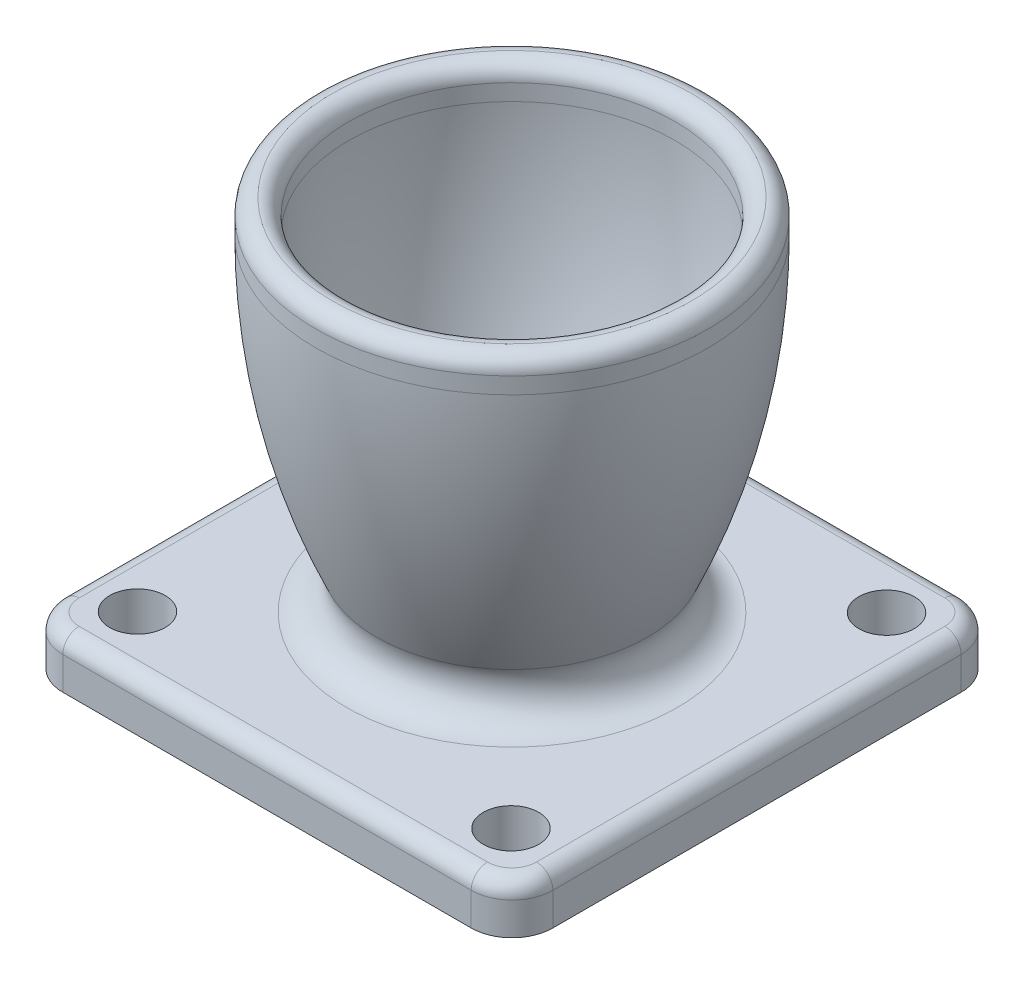
ISO-10303-21;
HEADER;
FILE_DESCRIPTION(('STEP AP214'),'2;1');
FILE_NAME('part.step','',(''),(''),'','','');
FILE_SCHEMA(('AUTOMOTIVE_DESIGN { 1 0 10303 214 1 1 1 1 }'));
ENDSEC;
DATA;
#1=APPLICATION_CONTEXT('core data for automotive mechanical design processes');
#2=APPLICATION_PROTOCOL_DEFINITION('international standard','automotive_design',2000,#1);
#3=PRODUCT_CONTEXT('',#1,'mechanical');
#4=PRODUCT('Part','Part','',(#3));
#5=PRODUCT_RELATED_PRODUCT_CATEGORY('part','',(#4));
#6=PRODUCT_DEFINITION_FORMATION('','',#4);
#7=PRODUCT_DEFINITION_CONTEXT('part definition',#1,'design');
#8=PRODUCT_DEFINITION('design','',#6,#7);
#9=PRODUCT_DEFINITION_SHAPE('','',#8);
#10=(LENGTH_UNIT() NAMED_UNIT(*) SI_UNIT(.MILLI.,.METRE.));
#11=(NAMED_UNIT(*) PLANE_ANGLE_UNIT() SI_UNIT($,.RADIAN.));
#12=(NAMED_UNIT(*) SI_UNIT($,.STERADIAN.) SOLID_ANGLE_UNIT());
#13=UNCERTAINTY_MEASURE_WITH_UNIT(LENGTH_MEASURE(1.E-05),#10,'distance_accuracy_value','');
#14=(GEOMETRIC_REPRESENTATION_CONTEXT(3) GLOBAL_UNCERTAINTY_ASSIGNED_CONTEXT((#13)) GLOBAL_UNIT_ASSIGNED_CONTEXT((#10,
#11,#12)) REPRESENTATION_CONTEXT('',''));
#15=CARTESIAN_POINT('',(0.,0.,0.));
#16=DIRECTION('',(0.,0.,1.));
#17=DIRECTION('',(1.,0.,0.));
#18=AXIS2_PLACEMENT_3D('',#15,#16,#17);
#19=CARTESIAN_POINT('',(0.,3.,0.));
#20=DIRECTION('',(0.,-1.,0.));
#21=DIRECTION('',(0.,0.,-1.));
#22=AXIS2_PLACEMENT_3D('',#19,#20,#21);
#23=PLANE('',#22);
#24=DIRECTION('',(0.,0.,1.));
#25=VECTOR('',#24,1.);
#26=CARTESIAN_POINT('',(-14.,3.,0.));
#27=LINE('',#26,#25);
#28=CARTESIAN_POINT('',(-14.,3.,-12.5));
#29=VERTEX_POINT('',#28);
#30=CARTESIAN_POINT('',(-14.,3.,12.5));
#31=VERTEX_POINT('',#30);
#32=EDGE_CURVE('E210',#29,#31,#27,.T.);
#33=ORIENTED_EDGE('',*,*,#32,.T.);
#34=CARTESIAN_POINT('',(-12.5,3.,12.5));
#35=DIRECTION('',(0.,-1.,0.));
#36=DIRECTION('',(0.,0.,-1.));
#37=AXIS2_PLACEMENT_3D('',#34,#35,#36);
#38=CIRCLE('',#37,1.5);
#39=CARTESIAN_POINT('',(-12.5,3.,14.));
#40=VERTEX_POINT('',#39);
#41=EDGE_CURVE('E212',#31,#40,#38,.F.);
#42=ORIENTED_EDGE('',*,*,#41,.T.);
#43=DIRECTION('',(1.,0.,0.));
#44=VECTOR('',#43,1.);
#45=CARTESIAN_POINT('',(0.,3.,14.));
#46=LINE('',#45,#44);
#47=CARTESIAN_POINT('',(12.5,3.,14.));
#48=VERTEX_POINT('',#47);
#49=EDGE_CURVE('E198',#40,#48,#46,.T.);
#50=ORIENTED_EDGE('',*,*,#49,.T.);
#51=CARTESIAN_POINT('',(12.5,3.,12.5));
#52=DIRECTION('',(0.,-1.,0.));
#53=DIRECTION('',(0.,0.,-1.));
#54=AXIS2_PLACEMENT_3D('',#51,#52,#53);
#55=CIRCLE('',#54,1.5);
#56=CARTESIAN_POINT('',(14.,3.,12.5));
#57=VERTEX_POINT('',#56);
#58=EDGE_CURVE('E200',#48,#57,#55,.F.);
#59=ORIENTED_EDGE('',*,*,#58,.T.);
#60=DIRECTION('',(0.,0.,-1.));
#61=VECTOR('',#60,1.);
#62=CARTESIAN_POINT('',(14.,3.,0.));
#63=LINE('',#62,#61);
#64=CARTESIAN_POINT('',(14.,3.,-12.5));
#65=VERTEX_POINT('',#64);
#66=EDGE_CURVE('E202',#57,#65,#63,.T.);
#67=ORIENTED_EDGE('',*,*,#66,.T.);
#68=CARTESIAN_POINT('',(12.5,3.,-12.5));
#69=DIRECTION('',(0.,-1.,0.));
#70=DIRECTION('',(0.,0.,-1.));
#71=AXIS2_PLACEMENT_3D('',#68,#69,#70);
#72=CIRCLE('',#71,1.5);
#73=CARTESIAN_POINT('',(12.5,3.,-14.));
#74=VERTEX_POINT('',#73);
#75=EDGE_CURVE('E204',#65,#74,#72,.F.);
#76=ORIENTED_EDGE('',*,*,#75,.T.);
#77=DIRECTION('',(-1.,0.,0.));
#78=VECTOR('',#77,1.);
#79=CARTESIAN_POINT('',(0.,3.,-14.));
#80=LINE('',#79,#78);
#81=CARTESIAN_POINT('',(-12.5,3.,-14.));
#82=VERTEX_POINT('',#81);
#83=EDGE_CURVE('E206',#74,#82,#80,.T.);
#84=ORIENTED_EDGE('',*,*,#83,.T.);
#85=CARTESIAN_POINT('',(-12.5,3.,-12.5));
#86=DIRECTION('',(0.,-1.,0.));
#87=DIRECTION('',(0.,0.,-1.));
#88=AXIS2_PLACEMENT_3D('',#85,#86,#87);
#89=CIRCLE('',#88,1.5);
#90=EDGE_CURVE('E208',#82,#29,#89,.F.);
#91=ORIENTED_EDGE('',*,*,#90,.T.);
#92=EDGE_LOOP('',(#33,#42,#50,#59,#67,#76,#84,#91));
#93=FACE_BOUND('',#92,.T.);
#94=CARTESIAN_POINT('',(0.,3.,0.));
#95=DIRECTION('',(0.,-1.,0.));
#96=DIRECTION('',(0.,0.,-1.));
#97=AXIS2_PLACEMENT_3D('',#94,#95,#96);
#98=CIRCLE('',#97,10.1255877699627);
#99=CARTESIAN_POINT('',(0.,3.,-10.1255877699627));
#100=VERTEX_POINT('',#99);
#101=EDGE_CURVE('E192',#100,#100,#98,.T.);
#102=ORIENTED_EDGE('',*,*,#101,.T.);
#103=EDGE_LOOP('',(#102));
#104=FACE_BOUND('',#103,.T.);
#105=CARTESIAN_POINT('',(-11.4337320000868,3.,-11.4954697101045));
#106=DIRECTION('',(0.,1.,0.));
#107=DIRECTION('',(0.,0.,1.));
#108=AXIS2_PLACEMENT_3D('',#105,#106,#107);
#109=CIRCLE('',#108,1.69999999999999);
#110=CARTESIAN_POINT('',(-11.4337320000868,3.,-9.79546971010449));
#111=VERTEX_POINT('',#110);
#112=EDGE_CURVE('E258',#111,#111,#109,.T.);
#113=ORIENTED_EDGE('',*,*,#112,.F.);
#114=EDGE_LOOP('',(#113));
#115=FACE_BOUND('',#114,.T.);
#116=CARTESIAN_POINT('',(11.4337320000868,3.,11.4954697101045));
#117=DIRECTION('',(0.,1.,0.));
#118=DIRECTION('',(0.,0.,1.));
#119=AXIS2_PLACEMENT_3D('',#116,#117,#118);
#120=CIRCLE('',#119,1.69999999999999);
#121=CARTESIAN_POINT('',(11.4337320000868,3.,13.1954697101045));
#122=VERTEX_POINT('',#121);
#123=EDGE_CURVE('E599',#122,#122,#120,.T.);
#124=ORIENTED_EDGE('',*,*,#123,.F.);
#125=EDGE_LOOP('',(#124));
#126=FACE_BOUND('',#125,.T.);
#127=CARTESIAN_POINT('',(-11.4954697101045,3.,11.4337320000868));
#128=DIRECTION('',(0.,1.,0.));
#129=DIRECTION('',(0.,0.,1.));
#130=AXIS2_PLACEMENT_3D('',#127,#128,#129);
#131=CIRCLE('',#130,1.69999999999999);
#132=CARTESIAN_POINT('',(-11.4954697101045,3.,13.1337320000868));
#133=VERTEX_POINT('',#132);
#134=EDGE_CURVE('E605',#133,#133,#131,.T.);
#135=ORIENTED_EDGE('',*,*,#134,.F.);
#136=EDGE_LOOP('',(#135));
#137=FACE_BOUND('',#136,.T.);
#138=CARTESIAN_POINT('',(11.4954697101045,3.,-11.4337320000868));
#139=DIRECTION('',(0.,1.,0.));
#140=DIRECTION('',(0.,0.,1.));
#141=AXIS2_PLACEMENT_3D('',#138,#139,#140);
#142=CIRCLE('',#141,1.69999999999999);
#143=CARTESIAN_POINT('',(11.4954697101045,3.,-9.73373200008682));
#144=VERTEX_POINT('',#143);
#145=EDGE_CURVE('E591',#144,#144,#142,.T.);
#146=ORIENTED_EDGE('',*,*,#145,.F.);
#147=EDGE_LOOP('',(#146));
#148=FACE_BOUND('',#147,.T.);
#149=ADVANCED_FACE('F37',(#93,#104,#115,#126,#137,#148),#23,.F.);
#150=CARTESIAN_POINT('',(0.,23.,0.));
#151=DIRECTION('',(0.,-1.,0.));
#152=DIRECTION('',(0.,0.,-1.));
#153=AXIS2_PLACEMENT_3D('',#150,#151,#152);
#154=DEGENERATE_TOROIDAL_SURFACE('',#153,29.75,41.75,.F.);
#155=CARTESIAN_POINT('',(0.,5.82285714285715,0.));
#156=DIRECTION('',(0.,1.,0.));
#157=DIRECTION('',(0.,0.,1.));
#158=AXIS2_PLACEMENT_3D('',#155,#156,#157);
#159=CIRCLE('',#158,8.30270375762156);
#160=CARTESIAN_POINT('',(0.,5.82285714285715,8.30270375762156));
#161=VERTEX_POINT('',#160);
#162=EDGE_CURVE('E195',#161,#161,#159,.T.);
#163=ORIENTED_EDGE('',*,*,#162,.T.);
#164=EDGE_LOOP('',(#163));
#165=FACE_BOUND('',#164,.T.);
#166=CARTESIAN_POINT('',(0.,23.,0.));
#167=DIRECTION('',(0.,-1.,0.));
#168=DIRECTION('',(0.,0.,-1.));
#169=AXIS2_PLACEMENT_3D('',#166,#167,#168);
#170=CIRCLE('',#169,12.);
#171=CARTESIAN_POINT('',(0.,23.,-12.));
#172=VERTEX_POINT('',#171);
#173=EDGE_CURVE('E173',#172,#172,#170,.T.);
#174=ORIENTED_EDGE('',*,*,#173,.T.);
#175=EDGE_LOOP('',(#174));
#176=FACE_BOUND('',#175,.T.);
#177=ADVANCED_FACE('F277',(#165,#176),#154,.F.);
#178=CARTESIAN_POINT('',(-6.,0.,0.));
#179=DIRECTION('',(0.,1.,0.));
#180=DIRECTION('',(0.,0.,1.));
#181=AXIS2_PLACEMENT_3D('',#178,#179,#180);
#182=PLANE('',#181);
#183=CARTESIAN_POINT('',(-11.4337320000868,0.,-11.4954697101045));
#184=DIRECTION('',(0.,1.,0.));
#185=DIRECTION('',(0.,0.,1.));
#186=AXIS2_PLACEMENT_3D('',#183,#184,#185);
#187=CIRCLE('',#186,1.7);
#188=CARTESIAN_POINT('',(-11.4337320000868,0.,-9.79546971010448));
#189=VERTEX_POINT('',#188);
#190=EDGE_CURVE('E586',#189,#189,#187,.T.);
#191=ORIENTED_EDGE('',*,*,#190,.T.);
#192=EDGE_LOOP('',(#191));
#193=FACE_BOUND('',#192,.T.);
#194=CARTESIAN_POINT('',(11.4954697101045,0.,-11.4337320000868));
#195=DIRECTION('',(0.,1.,0.));
#196=DIRECTION('',(0.,0.,1.));
#197=AXIS2_PLACEMENT_3D('',#194,#195,#196);
#198=CIRCLE('',#197,1.7);
#199=CARTESIAN_POINT('',(11.4954697101045,0.,-9.73373200008681));
#200=VERTEX_POINT('',#199);
#201=EDGE_CURVE('E596',#200,#200,#198,.T.);
#202=ORIENTED_EDGE('',*,*,#201,.T.);
#203=EDGE_LOOP('',(#202));
#204=FACE_BOUND('',#203,.T.);
#205=CARTESIAN_POINT('',(11.4337320000868,0.,11.4954697101045));
#206=DIRECTION('',(0.,1.,0.));
#207=DIRECTION('',(0.,0.,1.));
#208=AXIS2_PLACEMENT_3D('',#205,#206,#207);
#209=CIRCLE('',#208,1.7);
#210=CARTESIAN_POINT('',(11.4337320000868,0.,13.1954697101045));
#211=VERTEX_POINT('',#210);
#212=EDGE_CURVE('E602',#211,#211,#209,.T.);
#213=ORIENTED_EDGE('',*,*,#212,.T.);
#214=EDGE_LOOP('',(#213));
#215=FACE_BOUND('',#214,.T.);
#216=CARTESIAN_POINT('',(-11.4954697101045,0.,11.4337320000868));
#217=DIRECTION('',(0.,1.,0.));
#218=DIRECTION('',(0.,0.,1.));
#219=AXIS2_PLACEMENT_3D('',#216,#217,#218);
#220=CIRCLE('',#219,1.7);
#221=CARTESIAN_POINT('',(-11.4954697101045,0.,13.1337320000868));
#222=VERTEX_POINT('',#221);
#223=EDGE_CURVE('E161',#222,#222,#220,.T.);
#224=ORIENTED_EDGE('',*,*,#223,.T.);
#225=EDGE_LOOP('',(#224));
#226=FACE_BOUND('',#225,.T.);
#227=CARTESIAN_POINT('',(0.,0.,0.));
#228=DIRECTION('',(0.,-1.,0.));
#229=DIRECTION('',(0.,0.,-1.));
#230=AXIS2_PLACEMENT_3D('',#227,#228,#229);
#231=CIRCLE('',#230,4.);
#232=CARTESIAN_POINT('',(0.,0.,-4.));
#233=VERTEX_POINT('',#232);
#234=EDGE_CURVE('E167',#233,#233,#231,.T.);
#235=ORIENTED_EDGE('',*,*,#234,.F.);
#236=EDGE_LOOP('',(#235));
#237=FACE_BOUND('',#236,.T.);
#238=DIRECTION('',(-1.,0.,0.));
#239=VECTOR('',#238,1.);
#240=CARTESIAN_POINT('',(-15.,0.,-15.));
#241=LINE('',#240,#239);
#242=CARTESIAN_POINT('',(12.5,0.,-15.));
#243=VERTEX_POINT('',#242);
#244=CARTESIAN_POINT('',(-12.5,0.,-15.));
#245=VERTEX_POINT('',#244);
#246=EDGE_CURVE('E133',#243,#245,#241,.T.);
#247=ORIENTED_EDGE('',*,*,#246,.F.);
#248=CARTESIAN_POINT('',(12.5,0.,-12.5));
#249=DIRECTION('',(0.,1.,0.));
#250=DIRECTION('',(0.,0.,1.));
#251=AXIS2_PLACEMENT_3D('',#248,#249,#250);
#252=CIRCLE('',#251,2.5);
#253=CARTESIAN_POINT('',(15.,0.,-12.5));
#254=VERTEX_POINT('',#253);
#255=EDGE_CURVE('E143',#243,#254,#252,.F.);
#256=ORIENTED_EDGE('',*,*,#255,.T.);
#257=DIRECTION('',(0.,0.,-1.));
#258=VECTOR('',#257,1.);
#259=CARTESIAN_POINT('',(15.,0.,15.));
#260=LINE('',#259,#258);
#261=CARTESIAN_POINT('',(15.,0.,12.5));
#262=VERTEX_POINT('',#261);
#263=EDGE_CURVE('E156',#262,#254,#260,.T.);
#264=ORIENTED_EDGE('',*,*,#263,.F.);
#265=CARTESIAN_POINT('',(12.5,0.,12.5));
#266=DIRECTION('',(0.,1.,0.));
#267=DIRECTION('',(0.,0.,1.));
#268=AXIS2_PLACEMENT_3D('',#265,#266,#267);
#269=CIRCLE('',#268,2.5);
#270=CARTESIAN_POINT('',(12.5,0.,15.));
#271=VERTEX_POINT('',#270);
#272=EDGE_CURVE('E139',#262,#271,#269,.F.);
#273=ORIENTED_EDGE('',*,*,#272,.T.);
#274=DIRECTION('',(1.,0.,0.));
#275=VECTOR('',#274,1.);
#276=CARTESIAN_POINT('',(-15.,0.,15.));
#277=LINE('',#276,#275);
#278=CARTESIAN_POINT('',(-12.5,0.,15.));
#279=VERTEX_POINT('',#278);
#280=EDGE_CURVE('E159',#279,#271,#277,.T.);
#281=ORIENTED_EDGE('',*,*,#280,.F.);
#282=CARTESIAN_POINT('',(-12.5,0.,12.5));
#283=DIRECTION('',(0.,1.,0.));
#284=DIRECTION('',(0.,0.,1.));
#285=AXIS2_PLACEMENT_3D('',#282,#283,#284);
#286=CIRCLE('',#285,2.5);
#287=CARTESIAN_POINT('',(-15.,0.,12.5));
#288=VERTEX_POINT('',#287);
#289=EDGE_CURVE('E178',#279,#288,#286,.F.);
#290=ORIENTED_EDGE('',*,*,#289,.T.);
#291=DIRECTION('',(0.,0.,1.));
#292=VECTOR('',#291,1.);
#293=CARTESIAN_POINT('',(-15.,0.,15.));
#294=LINE('',#293,#292);
#295=CARTESIAN_POINT('',(-15.,0.,-12.5));
#296=VERTEX_POINT('',#295);
#297=EDGE_CURVE('E155',#296,#288,#294,.T.);
#298=ORIENTED_EDGE('',*,*,#297,.F.);
#299=CARTESIAN_POINT('',(-12.5,0.,-12.5));
#300=DIRECTION('',(0.,1.,0.));
#301=DIRECTION('',(0.,0.,1.));
#302=AXIS2_PLACEMENT_3D('',#299,#300,#301);
#303=CIRCLE('',#302,2.5);
#304=EDGE_CURVE('E150',#296,#245,#303,.F.);
#305=ORIENTED_EDGE('',*,*,#304,.T.);
#306=EDGE_LOOP('',(#247,#256,#264,#273,#281,#290,#298,#305));
#307=FACE_BOUND('',#306,.T.);
#308=ADVANCED_FACE('F152',(#193,#204,#215,#226,#237,#307),#182,.F.);
#309=CARTESIAN_POINT('',(0.,0.,0.));
#310=DIRECTION('',(0.,-1.,0.));
#311=DIRECTION('',(0.,0.,-1.));
#312=AXIS2_PLACEMENT_3D('',#309,#310,#311);
#313=CYLINDRICAL_SURFACE('',#312,12.);
#314=CARTESIAN_POINT('',(0.,24.,0.));
#315=DIRECTION('',(0.,-1.,0.));
#316=DIRECTION('',(0.,0.,-1.));
#317=AXIS2_PLACEMENT_3D('',#314,#315,#316);
#318=CIRCLE('',#317,12.);
#319=CARTESIAN_POINT('',(0.,24.,-12.));
#320=VERTEX_POINT('',#319);
#321=EDGE_CURVE('E232',#320,#320,#318,.T.);
#322=ORIENTED_EDGE('',*,*,#321,.T.);
#323=EDGE_LOOP('',(#322));
#324=FACE_BOUND('',#323,.T.);
#325=ORIENTED_EDGE('',*,*,#173,.F.);
#326=EDGE_LOOP('',(#325));
#327=FACE_BOUND('',#326,.T.);
#328=ADVANCED_FACE('F312',(#324,#327),#313,.T.);
#329=CARTESIAN_POINT('',(0.,0.,0.));
#330=DIRECTION('',(0.,-1.,0.));
#331=DIRECTION('',(0.,0.,-1.));
#332=AXIS2_PLACEMENT_3D('',#329,#330,#331);
#333=CYLINDRICAL_SURFACE('',#332,10.);
#334=CARTESIAN_POINT('',(0.,24.,0.));
#335=DIRECTION('',(0.,-1.,0.));
#336=DIRECTION('',(0.,0.,-1.));
#337=AXIS2_PLACEMENT_3D('',#334,#335,#336);
#338=CIRCLE('',#337,10.);
#339=CARTESIAN_POINT('',(0.,24.,-10.));
#340=VERTEX_POINT('',#339);
#341=EDGE_CURVE('E229',#340,#340,#338,.F.);
#342=ORIENTED_EDGE('',*,*,#341,.T.);
#343=EDGE_LOOP('',(#342));
#344=FACE_BOUND('',#343,.T.);
#345=CARTESIAN_POINT('',(0.,23.,0.));
#346=DIRECTION('',(0.,-1.,0.));
#347=DIRECTION('',(0.,0.,-1.));
#348=AXIS2_PLACEMENT_3D('',#345,#346,#347);
#349=CIRCLE('',#348,9.99999999999999);
#350=CARTESIAN_POINT('',(0.,23.,-9.99999999999999));
#351=VERTEX_POINT('',#350);
#352=EDGE_CURVE('E170',#351,#351,#349,.T.);
#353=ORIENTED_EDGE('',*,*,#352,.T.);
#354=EDGE_LOOP('',(#353));
#355=FACE_BOUND('',#354,.T.);
#356=ADVANCED_FACE('F309',(#344,#355),#333,.F.);
#357=CARTESIAN_POINT('',(0.,23.,0.));
#358=DIRECTION('',(0.,-1.,0.));
#359=DIRECTION('',(0.,0.,-1.));
#360=AXIS2_PLACEMENT_3D('',#357,#358,#359);
#361=DEGENERATE_TOROIDAL_SURFACE('',#360,29.75,39.75,.F.);
#362=CARTESIAN_POINT('',(0.,2.69232504569119,0.));
#363=DIRECTION('',(0.,1.,0.));
#364=DIRECTION('',(0.,0.,1.));
#365=AXIS2_PLACEMENT_3D('',#362,#363,#364);
#366=CIRCLE('',#365,4.42105263157894);
#367=CARTESIAN_POINT('',(0.,2.69232504569119,4.42105263157894));
#368=VERTEX_POINT('',#367);
#369=EDGE_CURVE('E45',#368,#368,#366,.F.);
#370=ORIENTED_EDGE('',*,*,#369,.T.);
#371=EDGE_LOOP('',(#370));
#372=FACE_BOUND('',#371,.T.);
#373=ORIENTED_EDGE('',*,*,#352,.F.);
#374=EDGE_LOOP('',(#373));
#375=FACE_BOUND('',#374,.T.);
#376=ADVANCED_FACE('F263',(#372,#375),#361,.T.);
#377=CARTESIAN_POINT('',(0.,0.,0.));
#378=DIRECTION('',(0.,-1.,0.));
#379=DIRECTION('',(0.,0.,-1.));
#380=AXIS2_PLACEMENT_3D('',#377,#378,#379);
#381=CYLINDRICAL_SURFACE('',#380,4.);
#382=CARTESIAN_POINT('',(0.,1.15967033215846,0.));
#383=DIRECTION('',(0.,1.,0.));
#384=DIRECTION('',(0.,0.,1.));
#385=AXIS2_PLACEMENT_3D('',#382,#383,#384);
#386=CIRCLE('',#385,4.);
#387=CARTESIAN_POINT('',(0.,1.15967033215846,4.));
#388=VERTEX_POINT('',#387);
#389=EDGE_CURVE('E11',#388,#388,#386,.T.);
#390=ORIENTED_EDGE('',*,*,#389,.T.);
#391=EDGE_LOOP('',(#390));
#392=FACE_BOUND('',#391,.T.);
#393=ORIENTED_EDGE('',*,*,#234,.T.);
#394=EDGE_LOOP('',(#393));
#395=FACE_BOUND('',#394,.T.);
#396=ADVANCED_FACE('F303',(#392,#395),#381,.F.);
#397=CARTESIAN_POINT('',(15.,3.,15.));
#398=DIRECTION('',(-1.,0.,0.));
#399=DIRECTION('',(0.,0.,1.));
#400=AXIS2_PLACEMENT_3D('',#397,#398,#399);
#401=PLANE('',#400);
#402=DIRECTION('',(0.,-1.,0.));
#403=VECTOR('',#402,1.);
#404=CARTESIAN_POINT('',(15.,3.,-12.5));
#405=LINE('',#404,#403);
#406=CARTESIAN_POINT('',(15.,2.,-12.5));
#407=VERTEX_POINT('',#406);
#408=EDGE_CURVE('E145',#254,#407,#405,.F.);
#409=ORIENTED_EDGE('',*,*,#408,.T.);
#410=DIRECTION('',(0.,0.,-1.));
#411=VECTOR('',#410,1.);
#412=CARTESIAN_POINT('',(15.,2.,15.));
#413=LINE('',#412,#411);
#414=CARTESIAN_POINT('',(15.,2.,12.5));
#415=VERTEX_POINT('',#414);
#416=EDGE_CURVE('E60',#407,#415,#413,.F.);
#417=ORIENTED_EDGE('',*,*,#416,.T.);
#418=DIRECTION('',(0.,-1.,0.));
#419=VECTOR('',#418,1.);
#420=CARTESIAN_POINT('',(15.,3.,12.5));
#421=LINE('',#420,#419);
#422=EDGE_CURVE('E149',#415,#262,#421,.T.);
#423=ORIENTED_EDGE('',*,*,#422,.T.);
#424=ORIENTED_EDGE('',*,*,#263,.T.);
#425=EDGE_LOOP('',(#409,#417,#423,#424));
#426=FACE_BOUND('',#425,.T.);
#427=ADVANCED_FACE('F300',(#426),#401,.F.);
#428=CARTESIAN_POINT('',(-15.,3.,-15.));
#429=DIRECTION('',(0.,0.,1.));
#430=DIRECTION('',(1.,0.,0.));
#431=AXIS2_PLACEMENT_3D('',#428,#429,#430);
#432=PLANE('',#431);
#433=DIRECTION('',(0.,-1.,0.));
#434=VECTOR('',#433,1.);
#435=CARTESIAN_POINT('',(-12.5,3.,-15.));
#436=LINE('',#435,#434);
#437=CARTESIAN_POINT('',(-12.5,2.,-15.));
#438=VERTEX_POINT('',#437);
#439=EDGE_CURVE('E140',#245,#438,#436,.F.);
#440=ORIENTED_EDGE('',*,*,#439,.T.);
#441=DIRECTION('',(-1.,0.,0.));
#442=VECTOR('',#441,1.);
#443=CARTESIAN_POINT('',(-15.,2.,-15.));
#444=LINE('',#443,#442);
#445=CARTESIAN_POINT('',(12.5,2.,-15.));
#446=VERTEX_POINT('',#445);
#447=EDGE_CURVE('E136',#438,#446,#444,.F.);
#448=ORIENTED_EDGE('',*,*,#447,.T.);
#449=DIRECTION('',(0.,-1.,0.));
#450=VECTOR('',#449,1.);
#451=CARTESIAN_POINT('',(12.5,3.,-15.));
#452=LINE('',#451,#450);
#453=EDGE_CURVE('E128',#446,#243,#452,.T.);
#454=ORIENTED_EDGE('',*,*,#453,.T.);
#455=ORIENTED_EDGE('',*,*,#246,.T.);
#456=EDGE_LOOP('',(#440,#448,#454,#455));
#457=FACE_BOUND('',#456,.T.);
#458=ADVANCED_FACE('F131',(#457),#432,.F.);
#459=CARTESIAN_POINT('',(-15.,3.,15.));
#460=DIRECTION('',(1.,0.,0.));
#461=DIRECTION('',(0.,0.,-1.));
#462=AXIS2_PLACEMENT_3D('',#459,#460,#461);
#463=PLANE('',#462);
#464=DIRECTION('',(0.,-1.,0.));
#465=VECTOR('',#464,1.);
#466=CARTESIAN_POINT('',(-15.,3.,12.5));
#467=LINE('',#466,#465);
#468=CARTESIAN_POINT('',(-15.,2.,12.5));
#469=VERTEX_POINT('',#468);
#470=EDGE_CURVE('E183',#288,#469,#467,.F.);
#471=ORIENTED_EDGE('',*,*,#470,.T.);
#472=DIRECTION('',(0.,0.,1.));
#473=VECTOR('',#472,1.);
#474=CARTESIAN_POINT('',(-15.,2.,15.));
#475=LINE('',#474,#473);
#476=CARTESIAN_POINT('',(-15.,2.,-12.5));
#477=VERTEX_POINT('',#476);
#478=EDGE_CURVE('E218',#469,#477,#475,.F.);
#479=ORIENTED_EDGE('',*,*,#478,.T.);
#480=DIRECTION('',(0.,-1.,0.));
#481=VECTOR('',#480,1.);
#482=CARTESIAN_POINT('',(-15.,3.,-12.5));
#483=LINE('',#482,#481);
#484=EDGE_CURVE('E186',#477,#296,#483,.T.);
#485=ORIENTED_EDGE('',*,*,#484,.T.);
#486=ORIENTED_EDGE('',*,*,#297,.T.);
#487=EDGE_LOOP('',(#471,#479,#485,#486));
#488=FACE_BOUND('',#487,.T.);
#489=ADVANCED_FACE('F293',(#488),#463,.F.);
#490=CARTESIAN_POINT('',(-15.,3.,15.));
#491=DIRECTION('',(0.,0.,-1.));
#492=DIRECTION('',(-1.,0.,0.));
#493=AXIS2_PLACEMENT_3D('',#490,#491,#492);
#494=PLANE('',#493);
#495=DIRECTION('',(0.,-1.,0.));
#496=VECTOR('',#495,1.);
#497=CARTESIAN_POINT('',(12.5,3.,15.));
#498=LINE('',#497,#496);
#499=CARTESIAN_POINT('',(12.5,2.,15.));
#500=VERTEX_POINT('',#499);
#501=EDGE_CURVE('E188',#271,#500,#498,.F.);
#502=ORIENTED_EDGE('',*,*,#501,.T.);
#503=DIRECTION('',(1.,0.,0.));
#504=VECTOR('',#503,1.);
#505=CARTESIAN_POINT('',(-15.,2.,15.));
#506=LINE('',#505,#504);
#507=CARTESIAN_POINT('',(-12.5,2.,15.));
#508=VERTEX_POINT('',#507);
#509=EDGE_CURVE('E227',#500,#508,#506,.F.);
#510=ORIENTED_EDGE('',*,*,#509,.T.);
#511=DIRECTION('',(0.,-1.,0.));
#512=VECTOR('',#511,1.);
#513=CARTESIAN_POINT('',(-12.5,3.,15.));
#514=LINE('',#513,#512);
#515=EDGE_CURVE('E190',#508,#279,#514,.T.);
#516=ORIENTED_EDGE('',*,*,#515,.T.);
#517=ORIENTED_EDGE('',*,*,#280,.T.);
#518=EDGE_LOOP('',(#502,#510,#516,#517));
#519=FACE_BOUND('',#518,.T.);
#520=ADVANCED_FACE('F290',(#519),#494,.F.);
#521=CARTESIAN_POINT('',(-11.4954697101045,3.,11.4337320000868));
#522=DIRECTION('',(0.,1.,0.));
#523=DIRECTION('',(0.,0.,1.));
#524=AXIS2_PLACEMENT_3D('',#521,#522,#523);
#525=CYLINDRICAL_SURFACE('',#524,1.69999999999999);
#526=ORIENTED_EDGE('',*,*,#223,.F.);
#527=EDGE_LOOP('',(#526));
#528=FACE_BOUND('',#527,.T.);
#529=ORIENTED_EDGE('',*,*,#134,.T.);
#530=EDGE_LOOP('',(#529));
#531=FACE_BOUND('',#530,.T.);
#532=ADVANCED_FACE('F288',(#528,#531),#525,.F.);
#533=CARTESIAN_POINT('',(11.4337320000868,3.,11.4954697101045));
#534=DIRECTION('',(0.,1.,0.));
#535=DIRECTION('',(0.,0.,1.));
#536=AXIS2_PLACEMENT_3D('',#533,#534,#535);
#537=CYLINDRICAL_SURFACE('',#536,1.69999999999999);
#538=ORIENTED_EDGE('',*,*,#212,.F.);
#539=EDGE_LOOP('',(#538));
#540=FACE_BOUND('',#539,.T.);
#541=ORIENTED_EDGE('',*,*,#123,.T.);
#542=EDGE_LOOP('',(#541));
#543=FACE_BOUND('',#542,.T.);
#544=ADVANCED_FACE('F430',(#540,#543),#537,.F.);
#545=CARTESIAN_POINT('',(11.4954697101045,3.,-11.4337320000868));
#546=DIRECTION('',(0.,1.,0.));
#547=DIRECTION('',(0.,0.,1.));
#548=AXIS2_PLACEMENT_3D('',#545,#546,#547);
#549=CYLINDRICAL_SURFACE('',#548,1.69999999999999);
#550=ORIENTED_EDGE('',*,*,#201,.F.);
#551=EDGE_LOOP('',(#550));
#552=FACE_BOUND('',#551,.T.);
#553=ORIENTED_EDGE('',*,*,#145,.T.);
#554=EDGE_LOOP('',(#553));
#555=FACE_BOUND('',#554,.T.);
#556=ADVANCED_FACE('F437',(#552,#555),#549,.F.);
#557=CARTESIAN_POINT('',(-11.4337320000868,3.,-11.4954697101045));
#558=DIRECTION('',(0.,1.,0.));
#559=DIRECTION('',(0.,0.,1.));
#560=AXIS2_PLACEMENT_3D('',#557,#558,#559);
#561=CYLINDRICAL_SURFACE('',#560,1.69999999999999);
#562=ORIENTED_EDGE('',*,*,#190,.F.);
#563=EDGE_LOOP('',(#562));
#564=FACE_BOUND('',#563,.T.);
#565=ORIENTED_EDGE('',*,*,#112,.T.);
#566=EDGE_LOOP('',(#565));
#567=FACE_BOUND('',#566,.T.);
#568=ADVANCED_FACE('F323',(#564,#567),#561,.F.);
#569=CARTESIAN_POINT('',(12.5,3.,-12.5));
#570=DIRECTION('',(0.,-1.,0.));
#571=DIRECTION('',(0.,0.,-1.));
#572=AXIS2_PLACEMENT_3D('',#569,#570,#571);
#573=CYLINDRICAL_SURFACE('',#572,2.5);
#574=ORIENTED_EDGE('',*,*,#453,.F.);
#575=CARTESIAN_POINT('',(12.5,2.,-12.5));
#576=DIRECTION('',(0.,-1.,0.));
#577=DIRECTION('',(0.,0.,-1.));
#578=AXIS2_PLACEMENT_3D('',#575,#576,#577);
#579=CIRCLE('',#578,2.5);
#580=EDGE_CURVE('E223',#446,#407,#579,.T.);
#581=ORIENTED_EDGE('',*,*,#580,.T.);
#582=ORIENTED_EDGE('',*,*,#408,.F.);
#583=ORIENTED_EDGE('',*,*,#255,.F.);
#584=EDGE_LOOP('',(#574,#581,#582,#583));
#585=FACE_BOUND('',#584,.T.);
#586=ADVANCED_FACE('F144',(#585),#573,.T.);
#587=CARTESIAN_POINT('',(-12.5,3.,-12.5));
#588=DIRECTION('',(0.,-1.,0.));
#589=DIRECTION('',(0.,0.,-1.));
#590=AXIS2_PLACEMENT_3D('',#587,#588,#589);
#591=CYLINDRICAL_SURFACE('',#590,2.5);
#592=ORIENTED_EDGE('',*,*,#484,.F.);
#593=CARTESIAN_POINT('',(-12.5,2.,-12.5));
#594=DIRECTION('',(0.,-1.,0.));
#595=DIRECTION('',(0.,0.,-1.));
#596=AXIS2_PLACEMENT_3D('',#593,#594,#595);
#597=CIRCLE('',#596,2.5);
#598=EDGE_CURVE('E220',#477,#438,#597,.T.);
#599=ORIENTED_EDGE('',*,*,#598,.T.);
#600=ORIENTED_EDGE('',*,*,#439,.F.);
#601=ORIENTED_EDGE('',*,*,#304,.F.);
#602=EDGE_LOOP('',(#592,#599,#600,#601));
#603=FACE_BOUND('',#602,.T.);
#604=ADVANCED_FACE('F322',(#603),#591,.T.);
#605=CARTESIAN_POINT('',(-12.5,3.,12.5));
#606=DIRECTION('',(0.,-1.,0.));
#607=DIRECTION('',(0.,0.,-1.));
#608=AXIS2_PLACEMENT_3D('',#605,#606,#607);
#609=CYLINDRICAL_SURFACE('',#608,2.5);
#610=ORIENTED_EDGE('',*,*,#515,.F.);
#611=CARTESIAN_POINT('',(-12.5,2.,12.5));
#612=DIRECTION('',(0.,-1.,0.));
#613=DIRECTION('',(0.,0.,-1.));
#614=AXIS2_PLACEMENT_3D('',#611,#612,#613);
#615=CIRCLE('',#614,2.5);
#616=EDGE_CURVE('E215',#508,#469,#615,.T.);
#617=ORIENTED_EDGE('',*,*,#616,.T.);
#618=ORIENTED_EDGE('',*,*,#470,.F.);
#619=ORIENTED_EDGE('',*,*,#289,.F.);
#620=EDGE_LOOP('',(#610,#617,#618,#619));
#621=FACE_BOUND('',#620,.T.);
#622=ADVANCED_FACE('F326',(#621),#609,.T.);
#623=CARTESIAN_POINT('',(12.5,3.,12.5));
#624=DIRECTION('',(0.,-1.,0.));
#625=DIRECTION('',(0.,0.,-1.));
#626=AXIS2_PLACEMENT_3D('',#623,#624,#625);
#627=CYLINDRICAL_SURFACE('',#626,2.5);
#628=ORIENTED_EDGE('',*,*,#422,.F.);
#629=CARTESIAN_POINT('',(12.5,2.,12.5));
#630=DIRECTION('',(0.,-1.,0.));
#631=DIRECTION('',(0.,0.,-1.));
#632=AXIS2_PLACEMENT_3D('',#629,#630,#631);
#633=CIRCLE('',#632,2.5);
#634=EDGE_CURVE('E52',#415,#500,#633,.T.);
#635=ORIENTED_EDGE('',*,*,#634,.T.);
#636=ORIENTED_EDGE('',*,*,#501,.F.);
#637=ORIENTED_EDGE('',*,*,#272,.F.);
#638=EDGE_LOOP('',(#628,#635,#636,#637));
#639=FACE_BOUND('',#638,.T.);
#640=ADVANCED_FACE('F330',(#639),#627,.T.);
#641=CARTESIAN_POINT('',(0.,5.,0.));
#642=DIRECTION('',(0.,-1.,0.));
#643=DIRECTION('',(0.,0.,-1.));
#644=AXIS2_PLACEMENT_3D('',#641,#642,#643);
#645=TOROIDAL_SURFACE('',#644,10.1255877699627,2.);
#646=ORIENTED_EDGE('',*,*,#162,.F.);
#647=EDGE_LOOP('',(#646));
#648=FACE_BOUND('',#647,.T.);
#649=ORIENTED_EDGE('',*,*,#101,.F.);
#650=EDGE_LOOP('',(#649));
#651=FACE_BOUND('',#650,.T.);
#652=ADVANCED_FACE('F334',(#648,#651),#645,.F.);
#653=CARTESIAN_POINT('',(12.5,2.,-12.5));
#654=DIRECTION('',(0.,-1.,0.));
#655=DIRECTION('',(0.,0.,-1.));
#656=AXIS2_PLACEMENT_3D('',#653,#654,#655);
#657=TOROIDAL_SURFACE('',#656,1.5,1.);
#658=CARTESIAN_POINT('',(14.,2.,-12.5));
#659=DIRECTION('',(0.,0.,1.));
#660=DIRECTION('',(1.,0.,0.));
#661=AXIS2_PLACEMENT_3D('',#658,#659,#660);
#662=CIRCLE('',#661,1.);
#663=EDGE_CURVE('E252',#407,#65,#662,.T.);
#664=ORIENTED_EDGE('',*,*,#663,.F.);
#665=ORIENTED_EDGE('',*,*,#580,.F.);
#666=CARTESIAN_POINT('',(12.5,2.,-14.));
#667=DIRECTION('',(-1.,0.,0.));
#668=DIRECTION('',(0.,0.,1.));
#669=AXIS2_PLACEMENT_3D('',#666,#667,#668);
#670=CIRCLE('',#669,1.);
#671=EDGE_CURVE('E255',#74,#446,#670,.T.);
#672=ORIENTED_EDGE('',*,*,#671,.F.);
#673=ORIENTED_EDGE('',*,*,#75,.F.);
#674=EDGE_LOOP('',(#664,#665,#672,#673));
#675=FACE_BOUND('',#674,.T.);
#676=ADVANCED_FACE('F337',(#675),#657,.T.);
#677=CARTESIAN_POINT('',(0.,2.,-14.));
#678=DIRECTION('',(-1.,0.,0.));
#679=DIRECTION('',(0.,0.,1.));
#680=AXIS2_PLACEMENT_3D('',#677,#678,#679);
#681=CYLINDRICAL_SURFACE('',#680,1.);
#682=ORIENTED_EDGE('',*,*,#671,.T.);
#683=ORIENTED_EDGE('',*,*,#447,.F.);
#684=CARTESIAN_POINT('',(-12.5,2.,-14.));
#685=DIRECTION('',(-1.,0.,0.));
#686=DIRECTION('',(0.,0.,1.));
#687=AXIS2_PLACEMENT_3D('',#684,#685,#686);
#688=CIRCLE('',#687,1.);
#689=EDGE_CURVE('E249',#82,#438,#688,.T.);
#690=ORIENTED_EDGE('',*,*,#689,.F.);
#691=ORIENTED_EDGE('',*,*,#83,.F.);
#692=EDGE_LOOP('',(#682,#683,#690,#691));
#693=FACE_BOUND('',#692,.T.);
#694=ADVANCED_FACE('F362',(#693),#681,.T.);
#695=CARTESIAN_POINT('',(14.,2.,0.));
#696=DIRECTION('',(0.,0.,-1.));
#697=DIRECTION('',(-1.,0.,0.));
#698=AXIS2_PLACEMENT_3D('',#695,#696,#697);
#699=CYLINDRICAL_SURFACE('',#698,1.);
#700=ORIENTED_EDGE('',*,*,#663,.T.);
#701=ORIENTED_EDGE('',*,*,#66,.F.);
#702=CARTESIAN_POINT('',(14.,2.,12.5));
#703=DIRECTION('',(0.,0.,1.));
#704=DIRECTION('',(1.,0.,0.));
#705=AXIS2_PLACEMENT_3D('',#702,#703,#704);
#706=CIRCLE('',#705,1.);
#707=EDGE_CURVE('E246',#415,#57,#706,.T.);
#708=ORIENTED_EDGE('',*,*,#707,.F.);
#709=ORIENTED_EDGE('',*,*,#416,.F.);
#710=EDGE_LOOP('',(#700,#701,#708,#709));
#711=FACE_BOUND('',#710,.T.);
#712=ADVANCED_FACE('F358',(#711),#699,.T.);
#713=CARTESIAN_POINT('',(-12.5,2.,-12.5));
#714=DIRECTION('',(0.,-1.,0.));
#715=DIRECTION('',(0.,0.,-1.));
#716=AXIS2_PLACEMENT_3D('',#713,#714,#715);
#717=TOROIDAL_SURFACE('',#716,1.5,1.);
#718=ORIENTED_EDGE('',*,*,#689,.T.);
#719=ORIENTED_EDGE('',*,*,#598,.F.);
#720=CARTESIAN_POINT('',(-14.,2.,-12.5));
#721=DIRECTION('',(0.,0.,1.));
#722=DIRECTION('',(1.,0.,0.));
#723=AXIS2_PLACEMENT_3D('',#720,#721,#722);
#724=CIRCLE('',#723,1.);
#725=EDGE_CURVE('E243',#29,#477,#724,.T.);
#726=ORIENTED_EDGE('',*,*,#725,.F.);
#727=ORIENTED_EDGE('',*,*,#90,.F.);
#728=EDGE_LOOP('',(#718,#719,#726,#727));
#729=FACE_BOUND('',#728,.T.);
#730=ADVANCED_FACE('F354',(#729),#717,.T.);
#731=CARTESIAN_POINT('',(12.5,2.,12.5));
#732=DIRECTION('',(0.,-1.,0.));
#733=DIRECTION('',(0.,0.,-1.));
#734=AXIS2_PLACEMENT_3D('',#731,#732,#733);
#735=TOROIDAL_SURFACE('',#734,1.5,1.);
#736=ORIENTED_EDGE('',*,*,#707,.T.);
#737=ORIENTED_EDGE('',*,*,#58,.F.);
#738=CARTESIAN_POINT('',(12.5,2.,14.));
#739=DIRECTION('',(-1.,0.,0.));
#740=DIRECTION('',(0.,0.,1.));
#741=AXIS2_PLACEMENT_3D('',#738,#739,#740);
#742=CIRCLE('',#741,1.);
#743=EDGE_CURVE('E240',#500,#48,#742,.T.);
#744=ORIENTED_EDGE('',*,*,#743,.F.);
#745=ORIENTED_EDGE('',*,*,#634,.F.);
#746=EDGE_LOOP('',(#736,#737,#744,#745));
#747=FACE_BOUND('',#746,.T.);
#748=ADVANCED_FACE('F350',(#747),#735,.T.);
#749=CARTESIAN_POINT('',(-14.,2.,0.));
#750=DIRECTION('',(0.,0.,1.));
#751=DIRECTION('',(1.,0.,0.));
#752=AXIS2_PLACEMENT_3D('',#749,#750,#751);
#753=CYLINDRICAL_SURFACE('',#752,1.);
#754=ORIENTED_EDGE('',*,*,#725,.T.);
#755=ORIENTED_EDGE('',*,*,#478,.F.);
#756=CARTESIAN_POINT('',(-14.,2.,12.5));
#757=DIRECTION('',(0.,0.,1.));
#758=DIRECTION('',(1.,0.,0.));
#759=AXIS2_PLACEMENT_3D('',#756,#757,#758);
#760=CIRCLE('',#759,1.);
#761=EDGE_CURVE('E237',#31,#469,#760,.T.);
#762=ORIENTED_EDGE('',*,*,#761,.F.);
#763=ORIENTED_EDGE('',*,*,#32,.F.);
#764=EDGE_LOOP('',(#754,#755,#762,#763));
#765=FACE_BOUND('',#764,.T.);
#766=ADVANCED_FACE('F346',(#765),#753,.T.);
#767=CARTESIAN_POINT('',(0.,2.,14.));
#768=DIRECTION('',(1.,0.,0.));
#769=DIRECTION('',(0.,0.,-1.));
#770=AXIS2_PLACEMENT_3D('',#767,#768,#769);
#771=CYLINDRICAL_SURFACE('',#770,1.);
#772=ORIENTED_EDGE('',*,*,#743,.T.);
#773=ORIENTED_EDGE('',*,*,#49,.F.);
#774=CARTESIAN_POINT('',(-12.5,2.,14.));
#775=DIRECTION('',(-1.,0.,0.));
#776=DIRECTION('',(0.,0.,1.));
#777=AXIS2_PLACEMENT_3D('',#774,#775,#776);
#778=CIRCLE('',#777,1.);
#779=EDGE_CURVE('E235',#508,#40,#778,.T.);
#780=ORIENTED_EDGE('',*,*,#779,.F.);
#781=ORIENTED_EDGE('',*,*,#509,.F.);
#782=EDGE_LOOP('',(#772,#773,#780,#781));
#783=FACE_BOUND('',#782,.T.);
#784=ADVANCED_FACE('F342',(#783),#771,.T.);
#785=CARTESIAN_POINT('',(-12.5,2.,12.5));
#786=DIRECTION('',(0.,-1.,0.));
#787=DIRECTION('',(0.,0.,-1.));
#788=AXIS2_PLACEMENT_3D('',#785,#786,#787);
#789=TOROIDAL_SURFACE('',#788,1.5,1.);
#790=ORIENTED_EDGE('',*,*,#761,.T.);
#791=ORIENTED_EDGE('',*,*,#616,.F.);
#792=ORIENTED_EDGE('',*,*,#779,.T.);
#793=ORIENTED_EDGE('',*,*,#41,.F.);
#794=EDGE_LOOP('',(#790,#791,#792,#793));
#795=FACE_BOUND('',#794,.T.);
#796=ADVANCED_FACE('F339',(#795),#789,.T.);
#797=CARTESIAN_POINT('',(0.,24.,0.));
#798=DIRECTION('',(0.,-1.,0.));
#799=DIRECTION('',(0.,0.,-1.));
#800=AXIS2_PLACEMENT_3D('',#797,#798,#799);
#801=TOROIDAL_SURFACE('',#800,11.,1.);
#802=ORIENTED_EDGE('',*,*,#321,.F.);
#803=EDGE_LOOP('',(#802));
#804=FACE_BOUND('',#803,.T.);
#805=CARTESIAN_POINT('',(0.,25.,0.));
#806=DIRECTION('',(0.,-1.,0.));
#807=DIRECTION('',(0.,0.,-1.));
#808=AXIS2_PLACEMENT_3D('',#805,#806,#807);
#809=CIRCLE('',#808,11.);
#810=CARTESIAN_POINT('',(0.,25.,-11.));
#811=VERTEX_POINT('',#810);
#812=EDGE_CURVE('E238',#811,#811,#809,.F.);
#813=ORIENTED_EDGE('',*,*,#812,.F.);
#814=EDGE_LOOP('',(#813));
#815=FACE_BOUND('',#814,.T.);
#816=ADVANCED_FACE('F272',(#804,#815),#801,.T.);
#817=CARTESIAN_POINT('',(0.,24.,0.));
#818=DIRECTION('',(0.,-1.,0.));
#819=DIRECTION('',(0.,0.,-1.));
#820=AXIS2_PLACEMENT_3D('',#817,#818,#819);
#821=TOROIDAL_SURFACE('',#820,11.,1.);
#822=ORIENTED_EDGE('',*,*,#341,.F.);
#823=EDGE_LOOP('',(#822));
#824=FACE_BOUND('',#823,.T.);
#825=ORIENTED_EDGE('',*,*,#812,.T.);
#826=EDGE_LOOP('',(#825));
#827=FACE_BOUND('',#826,.T.);
#828=ADVANCED_FACE('F267',(#824,#827),#821,.T.);
#829=CARTESIAN_POINT('',(0.,1.15967033215846,0.));
#830=DIRECTION('',(0.,1.,0.));
#831=DIRECTION('',(0.,0.,1.));
#832=AXIS2_PLACEMENT_3D('',#829,#830,#831);
#833=TOROIDAL_SURFACE('',#832,7.,3.);
#834=ORIENTED_EDGE('',*,*,#389,.F.);
#835=EDGE_LOOP('',(#834));
#836=FACE_BOUND('',#835,.T.);
#837=ORIENTED_EDGE('',*,*,#369,.F.);
#838=EDGE_LOOP('',(#837));
#839=FACE_BOUND('',#838,.T.);
#840=ADVANCED_FACE('F39',(#836,#839),#833,.T.);
#841=CLOSED_SHELL('',(#149,#177,#308,#328,#356,#376,#396,#427,#458,#489,#520,#532,#544,#556,
#568,#586,#604,#622,#640,#652,#676,#694,#712,#730,#748,#766,#784,#796,#816,#828,#840));
#842=MANIFOLD_SOLID_BREP('B2',#841);
#843=ADVANCED_BREP_SHAPE_REPRESENTATION('',(#18,#842),#14);
#844=SHAPE_DEFINITION_REPRESENTATION(#9,#843);
ENDSEC;
END-ISO-10303-21;
